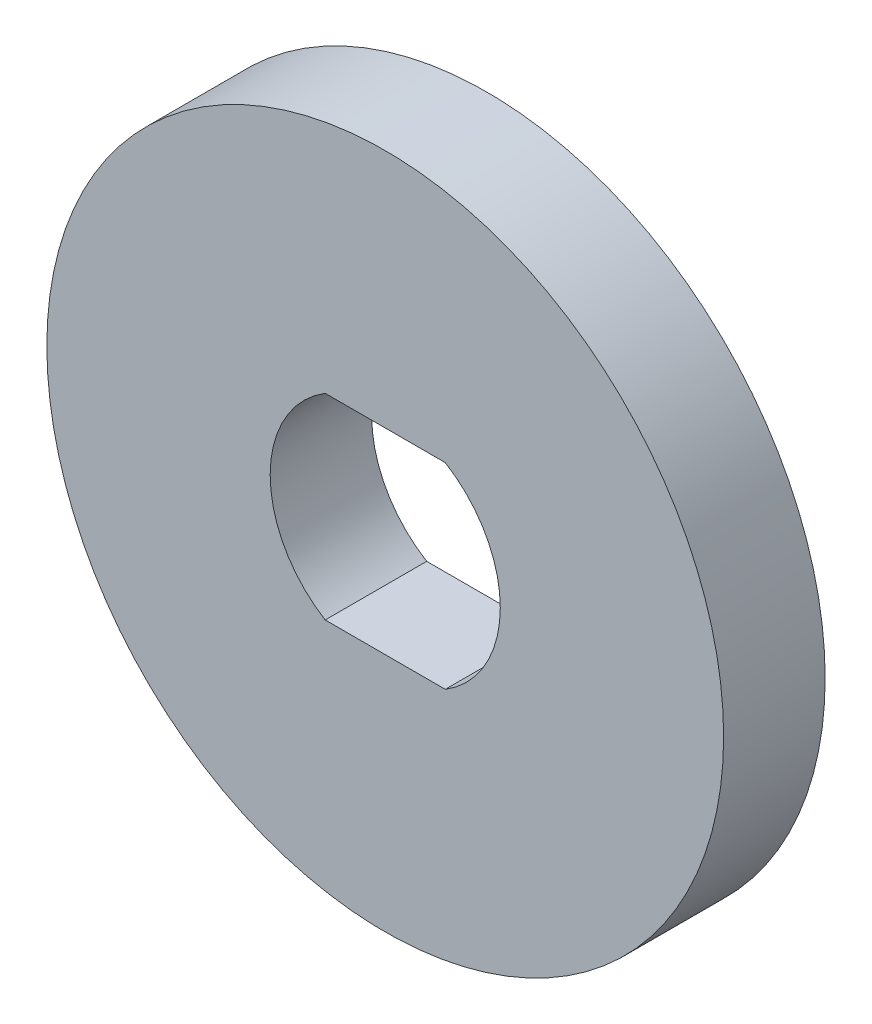
ISO-10303-21;
HEADER;
FILE_DESCRIPTION(('STEP AP214'),'2;1');
FILE_NAME('part.step','',(''),(''),'','','');
FILE_SCHEMA(('AUTOMOTIVE_DESIGN { 1 0 10303 214 1 1 1 1 }'));
ENDSEC;
DATA;
#1=APPLICATION_CONTEXT('core data for automotive mechanical design processes');
#2=APPLICATION_PROTOCOL_DEFINITION('international standard','automotive_design',2000,#1);
#3=PRODUCT_CONTEXT('',#1,'mechanical');
#4=PRODUCT('Part','Part','',(#3));
#5=PRODUCT_RELATED_PRODUCT_CATEGORY('part','',(#4));
#6=PRODUCT_DEFINITION_FORMATION('','',#4);
#7=PRODUCT_DEFINITION_CONTEXT('part definition',#1,'design');
#8=PRODUCT_DEFINITION('design','',#6,#7);
#9=PRODUCT_DEFINITION_SHAPE('','',#8);
#10=(LENGTH_UNIT() NAMED_UNIT(*) SI_UNIT(.MILLI.,.METRE.));
#11=(NAMED_UNIT(*) PLANE_ANGLE_UNIT() SI_UNIT($,.RADIAN.));
#12=(NAMED_UNIT(*) SI_UNIT($,.STERADIAN.) SOLID_ANGLE_UNIT());
#13=UNCERTAINTY_MEASURE_WITH_UNIT(LENGTH_MEASURE(1.E-05),#10,'distance_accuracy_value','');
#14=(GEOMETRIC_REPRESENTATION_CONTEXT(3) GLOBAL_UNCERTAINTY_ASSIGNED_CONTEXT((#13)) GLOBAL_UNIT_ASSIGNED_CONTEXT((#10,
#11,#12)) REPRESENTATION_CONTEXT('',''));
#15=CARTESIAN_POINT('',(0.,0.,0.));
#16=DIRECTION('',(0.,0.,1.));
#17=DIRECTION('',(1.,0.,0.));
#18=AXIS2_PLACEMENT_3D('',#15,#16,#17);
#19=CARTESIAN_POINT('',(0.,0.,3.));
#20=DIRECTION('',(0.,0.,1.));
#21=DIRECTION('',(1.,0.,0.));
#22=AXIS2_PLACEMENT_3D('',#19,#20,#21);
#23=PLANE('',#22);
#24=CARTESIAN_POINT('',(0.,0.,3.));
#25=DIRECTION('',(0.,0.,1.));
#26=DIRECTION('',(1.,0.,0.));
#27=AXIS2_PLACEMENT_3D('',#24,#25,#26);
#28=CIRCLE('',#27,10.);
#29=CARTESIAN_POINT('',(10.,0.,3.));
#30=VERTEX_POINT('',#29);
#31=EDGE_CURVE('E11',#30,#30,#28,.T.);
#32=ORIENTED_EDGE('',*,*,#31,.T.);
#33=EDGE_LOOP('',(#32));
#34=FACE_BOUND('',#33,.T.);
#35=DIRECTION('',(1.,0.,0.));
#36=VECTOR('',#35,1.);
#37=CARTESIAN_POINT('',(-1.77482393492988,-2.9,3.));
#38=LINE('',#37,#36);
#39=CARTESIAN_POINT('',(-1.77482393492988,-2.9,3.));
#40=VERTEX_POINT('',#39);
#41=CARTESIAN_POINT('',(1.77482393492988,-2.9,3.));
#42=VERTEX_POINT('',#41);
#43=EDGE_CURVE('E96',#40,#42,#38,.T.);
#44=ORIENTED_EDGE('',*,*,#43,.F.);
#45=CARTESIAN_POINT('',(0.,0.,3.));
#46=DIRECTION('',(0.,0.,1.));
#47=DIRECTION('',(1.,0.,0.));
#48=AXIS2_PLACEMENT_3D('',#45,#46,#47);
#49=CIRCLE('',#48,3.4);
#50=CARTESIAN_POINT('',(-1.77482393492988,2.9,3.));
#51=VERTEX_POINT('',#50);
#52=EDGE_CURVE('E87',#51,#40,#49,.T.);
#53=ORIENTED_EDGE('',*,*,#52,.F.);
#54=DIRECTION('',(-1.,0.,0.));
#55=VECTOR('',#54,1.);
#56=CARTESIAN_POINT('',(-1.77482393492988,2.9,3.));
#57=LINE('',#56,#55);
#58=CARTESIAN_POINT('',(1.77482393492988,2.9,3.));
#59=VERTEX_POINT('',#58);
#60=EDGE_CURVE('E112',#59,#51,#57,.T.);
#61=ORIENTED_EDGE('',*,*,#60,.F.);
#62=CARTESIAN_POINT('',(0.,0.,3.));
#63=DIRECTION('',(0.,0.,1.));
#64=DIRECTION('',(1.,0.,0.));
#65=AXIS2_PLACEMENT_3D('',#62,#63,#64);
#66=CIRCLE('',#65,3.4);
#67=EDGE_CURVE('E108',#42,#59,#66,.T.);
#68=ORIENTED_EDGE('',*,*,#67,.F.);
#69=EDGE_LOOP('',(#44,#53,#61,#68));
#70=FACE_BOUND('',#69,.T.);
#71=ADVANCED_FACE('F45',(#34,#70),#23,.T.);
#72=CARTESIAN_POINT('',(0.,0.,0.));
#73=DIRECTION('',(0.,0.,1.));
#74=DIRECTION('',(1.,0.,0.));
#75=AXIS2_PLACEMENT_3D('',#72,#73,#74);
#76=PLANE('',#75);
#77=CARTESIAN_POINT('',(0.,0.,0.));
#78=DIRECTION('',(0.,0.,1.));
#79=DIRECTION('',(1.,0.,0.));
#80=AXIS2_PLACEMENT_3D('',#77,#78,#79);
#81=CIRCLE('',#80,10.);
#82=CARTESIAN_POINT('',(10.,0.,0.));
#83=VERTEX_POINT('',#82);
#84=EDGE_CURVE('E49',#83,#83,#81,.T.);
#85=ORIENTED_EDGE('',*,*,#84,.F.);
#86=EDGE_LOOP('',(#85));
#87=FACE_BOUND('',#86,.T.);
#88=CARTESIAN_POINT('',(0.,0.,0.));
#89=DIRECTION('',(0.,0.,1.));
#90=DIRECTION('',(1.,0.,0.));
#91=AXIS2_PLACEMENT_3D('',#88,#89,#90);
#92=CIRCLE('',#91,3.4);
#93=CARTESIAN_POINT('',(-1.77482393492988,2.9,0.));
#94=VERTEX_POINT('',#93);
#95=CARTESIAN_POINT('',(-1.77482393492988,-2.9,0.));
#96=VERTEX_POINT('',#95);
#97=EDGE_CURVE('E69',#94,#96,#92,.T.);
#98=ORIENTED_EDGE('',*,*,#97,.T.);
#99=DIRECTION('',(1.,0.,0.));
#100=VECTOR('',#99,1.);
#101=CARTESIAN_POINT('',(-1.77482393492988,-2.9,0.));
#102=LINE('',#101,#100);
#103=CARTESIAN_POINT('',(1.77482393492988,-2.9,0.));
#104=VERTEX_POINT('',#103);
#105=EDGE_CURVE('E103',#96,#104,#102,.T.);
#106=ORIENTED_EDGE('',*,*,#105,.T.);
#107=CARTESIAN_POINT('',(0.,0.,0.));
#108=DIRECTION('',(0.,0.,1.));
#109=DIRECTION('',(1.,0.,0.));
#110=AXIS2_PLACEMENT_3D('',#107,#108,#109);
#111=CIRCLE('',#110,3.4);
#112=CARTESIAN_POINT('',(1.77482393492988,2.9,0.));
#113=VERTEX_POINT('',#112);
#114=EDGE_CURVE('E121',#104,#113,#111,.T.);
#115=ORIENTED_EDGE('',*,*,#114,.T.);
#116=DIRECTION('',(-1.,0.,0.));
#117=VECTOR('',#116,1.);
#118=CARTESIAN_POINT('',(-1.77482393492988,2.9,0.));
#119=LINE('',#118,#117);
#120=EDGE_CURVE('E97',#113,#94,#119,.T.);
#121=ORIENTED_EDGE('',*,*,#120,.T.);
#122=EDGE_LOOP('',(#98,#106,#115,#121));
#123=FACE_BOUND('',#122,.T.);
#124=ADVANCED_FACE('F137',(#87,#123),#76,.F.);
#125=CARTESIAN_POINT('',(0.,0.,3.));
#126=DIRECTION('',(0.,0.,-1.));
#127=DIRECTION('',(-1.,0.,0.));
#128=AXIS2_PLACEMENT_3D('',#125,#126,#127);
#129=CYLINDRICAL_SURFACE('',#128,10.);
#130=ORIENTED_EDGE('',*,*,#31,.F.);
#131=EDGE_LOOP('',(#130));
#132=FACE_BOUND('',#131,.T.);
#133=ORIENTED_EDGE('',*,*,#84,.T.);
#134=EDGE_LOOP('',(#133));
#135=FACE_BOUND('',#134,.T.);
#136=ADVANCED_FACE('F47',(#132,#135),#129,.T.);
#137=CARTESIAN_POINT('',(0.,0.,3.));
#138=DIRECTION('',(0.,0.,-1.));
#139=DIRECTION('',(-1.,0.,0.));
#140=AXIS2_PLACEMENT_3D('',#137,#138,#139);
#141=CYLINDRICAL_SURFACE('',#140,3.4);
#142=ORIENTED_EDGE('',*,*,#97,.F.);
#143=DIRECTION('',(0.,0.,-1.));
#144=VECTOR('',#143,1.);
#145=CARTESIAN_POINT('',(-1.77482393492988,2.9,3.));
#146=LINE('',#145,#144);
#147=EDGE_CURVE('E91',#51,#94,#146,.T.);
#148=ORIENTED_EDGE('',*,*,#147,.F.);
#149=ORIENTED_EDGE('',*,*,#52,.T.);
#150=DIRECTION('',(0.,0.,-1.));
#151=VECTOR('',#150,1.);
#152=CARTESIAN_POINT('',(-1.77482393492988,-2.9,3.));
#153=LINE('',#152,#151);
#154=EDGE_CURVE('E90',#40,#96,#153,.T.);
#155=ORIENTED_EDGE('',*,*,#154,.T.);
#156=EDGE_LOOP('',(#142,#148,#149,#155));
#157=FACE_BOUND('',#156,.T.);
#158=ADVANCED_FACE('F89',(#157),#141,.F.);
#159=CARTESIAN_POINT('',(-1.77482393492988,-2.9,3.));
#160=DIRECTION('',(0.,1.,0.));
#161=DIRECTION('',(0.,0.,1.));
#162=AXIS2_PLACEMENT_3D('',#159,#160,#161);
#163=PLANE('',#162);
#164=ORIENTED_EDGE('',*,*,#105,.F.);
#165=ORIENTED_EDGE('',*,*,#154,.F.);
#166=ORIENTED_EDGE('',*,*,#43,.T.);
#167=DIRECTION('',(0.,0.,-1.));
#168=VECTOR('',#167,1.);
#169=CARTESIAN_POINT('',(1.77482393492988,-2.9,3.));
#170=LINE('',#169,#168);
#171=EDGE_CURVE('E105',#42,#104,#170,.T.);
#172=ORIENTED_EDGE('',*,*,#171,.T.);
#173=EDGE_LOOP('',(#164,#165,#166,#172));
#174=FACE_BOUND('',#173,.T.);
#175=ADVANCED_FACE('F100',(#174),#163,.T.);
#176=CARTESIAN_POINT('',(0.,0.,3.));
#177=DIRECTION('',(0.,0.,-1.));
#178=DIRECTION('',(-1.,0.,0.));
#179=AXIS2_PLACEMENT_3D('',#176,#177,#178);
#180=CYLINDRICAL_SURFACE('',#179,3.4);
#181=ORIENTED_EDGE('',*,*,#114,.F.);
#182=ORIENTED_EDGE('',*,*,#171,.F.);
#183=ORIENTED_EDGE('',*,*,#67,.T.);
#184=DIRECTION('',(0.,0.,-1.));
#185=VECTOR('',#184,1.);
#186=CARTESIAN_POINT('',(1.77482393492988,2.9,3.));
#187=LINE('',#186,#185);
#188=EDGE_CURVE('E61',#59,#113,#187,.T.);
#189=ORIENTED_EDGE('',*,*,#188,.T.);
#190=EDGE_LOOP('',(#181,#182,#183,#189));
#191=FACE_BOUND('',#190,.T.);
#192=ADVANCED_FACE('F135',(#191),#180,.F.);
#193=CARTESIAN_POINT('',(-1.77482393492988,2.9,3.));
#194=DIRECTION('',(0.,-1.,0.));
#195=DIRECTION('',(0.,0.,-1.));
#196=AXIS2_PLACEMENT_3D('',#193,#194,#195);
#197=PLANE('',#196);
#198=ORIENTED_EDGE('',*,*,#120,.F.);
#199=ORIENTED_EDGE('',*,*,#188,.F.);
#200=ORIENTED_EDGE('',*,*,#60,.T.);
#201=ORIENTED_EDGE('',*,*,#147,.T.);
#202=EDGE_LOOP('',(#198,#199,#200,#201));
#203=FACE_BOUND('',#202,.T.);
#204=ADVANCED_FACE('F138',(#203),#197,.T.);
#205=CLOSED_SHELL('',(#71,#124,#136,#158,#175,#192,#204));
#206=MANIFOLD_SOLID_BREP('B2',#205);
#207=ADVANCED_BREP_SHAPE_REPRESENTATION('',(#18,#206),#14);
#208=SHAPE_DEFINITION_REPRESENTATION(#9,#207);
ENDSEC;
END-ISO-10303-21;
